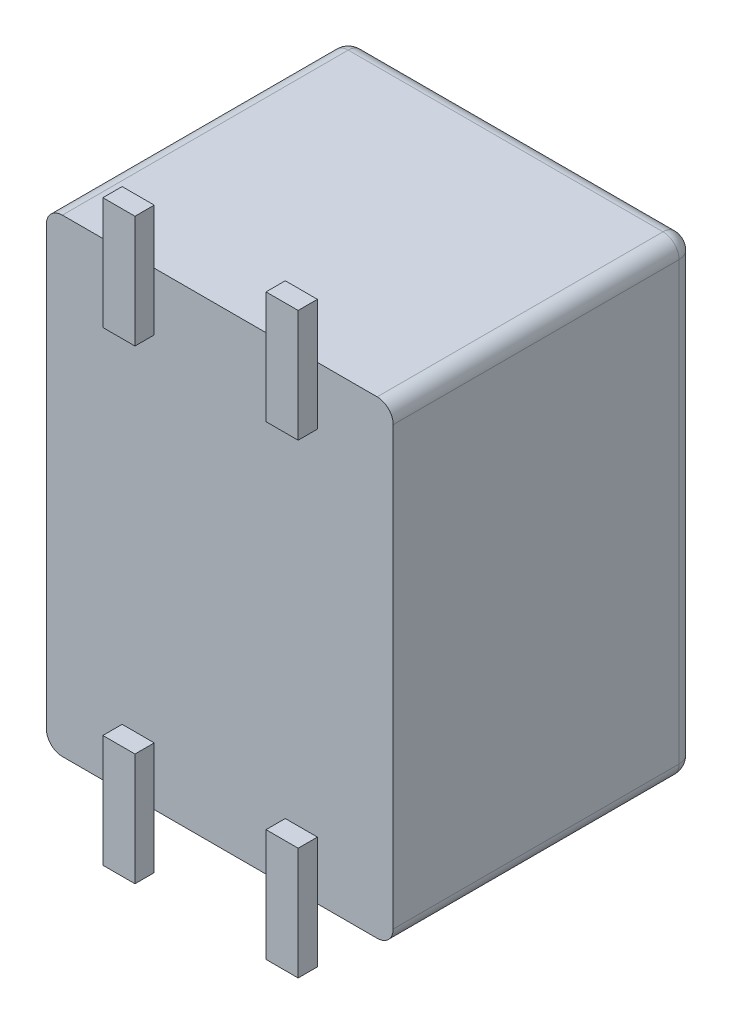
ISO-10303-21;
HEADER;
FILE_DESCRIPTION(('STEP AP214'),'2;1');
FILE_NAME('part.step','',(''),(''),'','','');
FILE_SCHEMA(('AUTOMOTIVE_DESIGN { 1 0 10303 214 1 1 1 1 }'));
ENDSEC;
DATA;
#1=APPLICATION_CONTEXT('core data for automotive mechanical design processes');
#2=APPLICATION_PROTOCOL_DEFINITION('international standard','automotive_design',2000,#1);
#3=PRODUCT_CONTEXT('',#1,'mechanical');
#4=PRODUCT('Part','Part','',(#3));
#5=PRODUCT_RELATED_PRODUCT_CATEGORY('part','',(#4));
#6=PRODUCT_DEFINITION_FORMATION('','',#4);
#7=PRODUCT_DEFINITION_CONTEXT('part definition',#1,'design');
#8=PRODUCT_DEFINITION('design','',#6,#7);
#9=PRODUCT_DEFINITION_SHAPE('','',#8);
#10=(LENGTH_UNIT() NAMED_UNIT(*) SI_UNIT(.MILLI.,.METRE.));
#11=(NAMED_UNIT(*) PLANE_ANGLE_UNIT() SI_UNIT($,.RADIAN.));
#12=(NAMED_UNIT(*) SI_UNIT($,.STERADIAN.) SOLID_ANGLE_UNIT());
#13=UNCERTAINTY_MEASURE_WITH_UNIT(LENGTH_MEASURE(1.E-05),#10,'distance_accuracy_value','');
#14=(GEOMETRIC_REPRESENTATION_CONTEXT(3) GLOBAL_UNCERTAINTY_ASSIGNED_CONTEXT((#13)) GLOBAL_UNIT_ASSIGNED_CONTEXT((#10,
#11,#12)) REPRESENTATION_CONTEXT('',''));
#15=CARTESIAN_POINT('',(0.,0.,0.));
#16=DIRECTION('',(0.,0.,1.));
#17=DIRECTION('',(1.,0.,0.));
#18=AXIS2_PLACEMENT_3D('',#15,#16,#17);
#19=CARTESIAN_POINT('',(-2.45,-3.4,-2.1));
#20=DIRECTION('',(0.,0.707106781186548,-0.707106781186548));
#21=DIRECTION('',(0.,-0.707106781186548,-0.707106781186548));
#22=AXIS2_PLACEMENT_3D('',#19,#20,#21);
#23=SPHERICAL_SURFACE('',#22,0.25);
#24=CARTESIAN_POINT('',(-2.45,-3.4,-2.1));
#25=DIRECTION('',(0.,0.,-1.));
#26=DIRECTION('',(0.,-1.,0.));
#27=AXIS2_PLACEMENT_3D('',#24,#25,#26);
#28=CIRCLE('',#27,0.25);
#29=CARTESIAN_POINT('',(-2.45,-3.65,-2.1));
#30=VERTEX_POINT('',#29);
#31=CARTESIAN_POINT('',(-2.7,-3.4,-2.1));
#32=VERTEX_POINT('',#31);
#33=EDGE_CURVE('E1019',#30,#32,#28,.T.);
#34=ORIENTED_EDGE('',*,*,#33,.T.);
#35=CARTESIAN_POINT('',(-2.45,-3.4,-2.1));
#36=DIRECTION('',(0.,-1.,0.));
#37=DIRECTION('',(-1.,0.,0.));
#38=AXIS2_PLACEMENT_3D('',#35,#36,#37);
#39=CIRCLE('',#38,0.25);
#40=CARTESIAN_POINT('',(-2.45,-3.4,-2.35));
#41=VERTEX_POINT('',#40);
#42=EDGE_CURVE('E318',#32,#41,#39,.T.);
#43=ORIENTED_EDGE('',*,*,#42,.T.);
#44=CARTESIAN_POINT('',(-2.45,-3.4,-2.1));
#45=DIRECTION('',(-1.,0.,0.));
#46=DIRECTION('',(0.,0.,-1.));
#47=AXIS2_PLACEMENT_3D('',#44,#45,#46);
#48=CIRCLE('',#47,0.25);
#49=EDGE_CURVE('E11',#41,#30,#48,.T.);
#50=ORIENTED_EDGE('',*,*,#49,.T.);
#51=EDGE_LOOP('',(#34,#43,#50));
#52=FACE_BOUND('',#51,.T.);
#53=ADVANCED_FACE('F17',(#52),#23,.T.);
#54=CARTESIAN_POINT('',(9.73944,-3.4,-2.1));
#55=DIRECTION('',(1.,0.,0.));
#56=DIRECTION('',(0.,0.,-1.));
#57=AXIS2_PLACEMENT_3D('',#54,#55,#56);
#58=CYLINDRICAL_SURFACE('',#57,0.25);
#59=CARTESIAN_POINT('',(2.45,-3.4,-2.1));
#60=DIRECTION('',(1.,0.,0.));
#61=DIRECTION('',(0.,-1.,0.));
#62=AXIS2_PLACEMENT_3D('',#59,#60,#61);
#63=CIRCLE('',#62,0.25);
#64=CARTESIAN_POINT('',(2.45,-3.65,-2.1));
#65=VERTEX_POINT('',#64);
#66=CARTESIAN_POINT('',(2.45,-3.4,-2.35));
#67=VERTEX_POINT('',#66);
#68=EDGE_CURVE('E20',#65,#67,#63,.T.);
#69=ORIENTED_EDGE('',*,*,#68,.F.);
#70=DIRECTION('',(-1.,0.,0.));
#71=VECTOR('',#70,1.);
#72=CARTESIAN_POINT('',(2.45,-3.65,-2.1));
#73=LINE('',#72,#71);
#74=EDGE_CURVE('E444',#65,#30,#73,.T.);
#75=ORIENTED_EDGE('',*,*,#74,.T.);
#76=ORIENTED_EDGE('',*,*,#49,.F.);
#77=DIRECTION('',(-1.,0.,0.));
#78=VECTOR('',#77,1.);
#79=CARTESIAN_POINT('',(2.45,-3.4,-2.35));
#80=LINE('',#79,#78);
#81=EDGE_CURVE('E303',#67,#41,#80,.T.);
#82=ORIENTED_EDGE('',*,*,#81,.F.);
#83=EDGE_LOOP('',(#69,#75,#76,#82));
#84=FACE_BOUND('',#83,.T.);
#85=ADVANCED_FACE('F308',(#84),#58,.T.);
#86=CARTESIAN_POINT('',(2.45,-3.4,-2.1));
#87=DIRECTION('',(-0.707106781186548,0.,-0.707106781186548));
#88=DIRECTION('',(0.707106781186548,0.,-0.707106781186548));
#89=AXIS2_PLACEMENT_3D('',#86,#87,#88);
#90=SPHERICAL_SURFACE('',#89,0.25);
#91=ORIENTED_EDGE('',*,*,#68,.T.);
#92=CARTESIAN_POINT('',(2.45,-3.4,-2.1));
#93=DIRECTION('',(0.,-1.,0.));
#94=DIRECTION('',(0.,0.,-1.));
#95=AXIS2_PLACEMENT_3D('',#92,#93,#94);
#96=CIRCLE('',#95,0.25);
#97=CARTESIAN_POINT('',(2.7,-3.4,-2.1));
#98=VERTEX_POINT('',#97);
#99=EDGE_CURVE('E282',#67,#98,#96,.T.);
#100=ORIENTED_EDGE('',*,*,#99,.T.);
#101=CARTESIAN_POINT('',(2.45,-3.4,-2.1));
#102=DIRECTION('',(0.,0.,-1.));
#103=DIRECTION('',(1.,0.,0.));
#104=AXIS2_PLACEMENT_3D('',#101,#102,#103);
#105=CIRCLE('',#104,0.25);
#106=EDGE_CURVE('E283',#98,#65,#105,.T.);
#107=ORIENTED_EDGE('',*,*,#106,.T.);
#108=EDGE_LOOP('',(#91,#100,#107));
#109=FACE_BOUND('',#108,.T.);
#110=ADVANCED_FACE('F281',(#109),#90,.T.);
#111=CARTESIAN_POINT('',(2.45,-3.4,9.168));
#112=DIRECTION('',(0.,0.,1.));
#113=DIRECTION('',(1.,0.,0.));
#114=AXIS2_PLACEMENT_3D('',#111,#112,#113);
#115=CYLINDRICAL_SURFACE('',#114,0.25);
#116=DIRECTION('',(0.,0.,-1.));
#117=VECTOR('',#116,1.);
#118=CARTESIAN_POINT('',(2.45,-3.65,2.35));
#119=LINE('',#118,#117);
#120=CARTESIAN_POINT('',(2.45,-3.65,2.35));
#121=VERTEX_POINT('',#120);
#122=EDGE_CURVE('E441',#121,#65,#119,.T.);
#123=ORIENTED_EDGE('',*,*,#122,.T.);
#124=ORIENTED_EDGE('',*,*,#106,.F.);
#125=DIRECTION('',(0.,0.,-1.));
#126=VECTOR('',#125,1.);
#127=CARTESIAN_POINT('',(2.7,-3.4,2.35));
#128=LINE('',#127,#126);
#129=CARTESIAN_POINT('',(2.7,-3.4,2.35));
#130=VERTEX_POINT('',#129);
#131=EDGE_CURVE('E404',#130,#98,#128,.T.);
#132=ORIENTED_EDGE('',*,*,#131,.F.);
#133=CARTESIAN_POINT('',(2.45,-3.4,2.35));
#134=DIRECTION('',(0.,0.,1.));
#135=DIRECTION('',(0.,-1.,0.));
#136=AXIS2_PLACEMENT_3D('',#133,#134,#135);
#137=CIRCLE('',#136,0.25);
#138=EDGE_CURVE('E1097',#121,#130,#137,.T.);
#139=ORIENTED_EDGE('',*,*,#138,.F.);
#140=EDGE_LOOP('',(#123,#124,#132,#139));
#141=FACE_BOUND('',#140,.T.);
#142=ADVANCED_FACE('F900',(#141),#115,.T.);
#143=CARTESIAN_POINT('',(-2.7,-3.65,2.35));
#144=DIRECTION('',(0.,-1.,0.));
#145=DIRECTION('',(0.,0.,-1.));
#146=AXIS2_PLACEMENT_3D('',#143,#144,#145);
#147=PLANE('',#146);
#148=ORIENTED_EDGE('',*,*,#74,.F.);
#149=ORIENTED_EDGE('',*,*,#122,.F.);
#150=DIRECTION('',(1.,0.,0.));
#151=VECTOR('',#150,1.);
#152=CARTESIAN_POINT('',(1.52,-3.65,2.35));
#153=LINE('',#152,#151);
#154=CARTESIAN_POINT('',(1.52,-3.65,2.35));
#155=VERTEX_POINT('',#154);
#156=EDGE_CURVE('E1093',#155,#121,#153,.T.);
#157=ORIENTED_EDGE('',*,*,#156,.F.);
#158=DIRECTION('',(1.,0.,0.));
#159=VECTOR('',#158,1.);
#160=CARTESIAN_POINT('',(1.02,-3.65,2.35));
#161=LINE('',#160,#159);
#162=CARTESIAN_POINT('',(1.02,-3.65,2.35));
#163=VERTEX_POINT('',#162);
#164=EDGE_CURVE('E462',#163,#155,#161,.T.);
#165=ORIENTED_EDGE('',*,*,#164,.F.);
#166=DIRECTION('',(1.,0.,0.));
#167=VECTOR('',#166,1.);
#168=CARTESIAN_POINT('',(-1.02,-3.65,2.35));
#169=LINE('',#168,#167);
#170=CARTESIAN_POINT('',(-1.02,-3.65,2.35));
#171=VERTEX_POINT('',#170);
#172=EDGE_CURVE('E1075',#171,#163,#169,.T.);
#173=ORIENTED_EDGE('',*,*,#172,.F.);
#174=DIRECTION('',(1.,0.,0.));
#175=VECTOR('',#174,1.);
#176=CARTESIAN_POINT('',(-1.52,-3.65,2.35));
#177=LINE('',#176,#175);
#178=CARTESIAN_POINT('',(-1.52,-3.65,2.35));
#179=VERTEX_POINT('',#178);
#180=EDGE_CURVE('E440',#179,#171,#177,.T.);
#181=ORIENTED_EDGE('',*,*,#180,.F.);
#182=DIRECTION('',(1.,0.,0.));
#183=VECTOR('',#182,1.);
#184=CARTESIAN_POINT('',(-2.45,-3.65,2.35));
#185=LINE('',#184,#183);
#186=CARTESIAN_POINT('',(-2.45,-3.65,2.35));
#187=VERTEX_POINT('',#186);
#188=EDGE_CURVE('E1085',#187,#179,#185,.T.);
#189=ORIENTED_EDGE('',*,*,#188,.F.);
#190=DIRECTION('',(0.,0.,1.));
#191=VECTOR('',#190,1.);
#192=CARTESIAN_POINT('',(-2.45,-3.65,-2.1));
#193=LINE('',#192,#191);
#194=EDGE_CURVE('E1023',#30,#187,#193,.T.);
#195=ORIENTED_EDGE('',*,*,#194,.F.);
#196=EDGE_LOOP('',(#148,#149,#157,#165,#173,#181,#189,#195));
#197=FACE_BOUND('',#196,.T.);
#198=ADVANCED_FACE('F826',(#197),#147,.T.);
#199=CARTESIAN_POINT('',(-1.52,-4.5,2.35));
#200=DIRECTION('',(0.,-1.,0.));
#201=DIRECTION('',(0.,0.,-1.));
#202=AXIS2_PLACEMENT_3D('',#199,#200,#201);
#203=PLANE('',#202);
#204=DIRECTION('',(0.,0.,1.));
#205=VECTOR('',#204,1.);
#206=CARTESIAN_POINT('',(-1.02,-4.5,2.35));
#207=LINE('',#206,#205);
#208=CARTESIAN_POINT('',(-1.02,-4.5,2.35));
#209=VERTEX_POINT('',#208);
#210=CARTESIAN_POINT('',(-1.02,-4.5,2.65));
#211=VERTEX_POINT('',#210);
#212=EDGE_CURVE('E476',#209,#211,#207,.T.);
#213=ORIENTED_EDGE('',*,*,#212,.T.);
#214=DIRECTION('',(1.,0.,0.));
#215=VECTOR('',#214,1.);
#216=CARTESIAN_POINT('',(-1.52,-4.5,2.65));
#217=LINE('',#216,#215);
#218=CARTESIAN_POINT('',(-1.52,-4.5,2.65));
#219=VERTEX_POINT('',#218);
#220=EDGE_CURVE('E360',#219,#211,#217,.T.);
#221=ORIENTED_EDGE('',*,*,#220,.F.);
#222=DIRECTION('',(0.,0.,1.));
#223=VECTOR('',#222,1.);
#224=CARTESIAN_POINT('',(-1.52,-4.5,2.35));
#225=LINE('',#224,#223);
#226=CARTESIAN_POINT('',(-1.52,-4.5,2.35));
#227=VERTEX_POINT('',#226);
#228=EDGE_CURVE('E341',#227,#219,#225,.T.);
#229=ORIENTED_EDGE('',*,*,#228,.F.);
#230=DIRECTION('',(1.,0.,0.));
#231=VECTOR('',#230,1.);
#232=CARTESIAN_POINT('',(-1.52,-4.5,2.35));
#233=LINE('',#232,#231);
#234=EDGE_CURVE('E376',#227,#209,#233,.T.);
#235=ORIENTED_EDGE('',*,*,#234,.T.);
#236=EDGE_LOOP('',(#213,#221,#229,#235));
#237=FACE_BOUND('',#236,.T.);
#238=ADVANCED_FACE('F821',(#237),#203,.T.);
#239=CARTESIAN_POINT('',(-1.02,-4.5,2.35));
#240=DIRECTION('',(1.,0.,0.));
#241=DIRECTION('',(0.,1.,0.));
#242=AXIS2_PLACEMENT_3D('',#239,#240,#241);
#243=PLANE('',#242);
#244=DIRECTION('',(0.,0.,1.));
#245=VECTOR('',#244,1.);
#246=CARTESIAN_POINT('',(-1.02,-2.75,2.35));
#247=LINE('',#246,#245);
#248=CARTESIAN_POINT('',(-1.02,-2.75,2.35));
#249=VERTEX_POINT('',#248);
#250=CARTESIAN_POINT('',(-1.02,-2.75,2.65));
#251=VERTEX_POINT('',#250);
#252=EDGE_CURVE('E479',#249,#251,#247,.T.);
#253=ORIENTED_EDGE('',*,*,#252,.T.);
#254=DIRECTION('',(0.,1.,0.));
#255=VECTOR('',#254,1.);
#256=CARTESIAN_POINT('',(-1.02,-4.5,2.65));
#257=LINE('',#256,#255);
#258=EDGE_CURVE('E455',#211,#251,#257,.T.);
#259=ORIENTED_EDGE('',*,*,#258,.F.);
#260=ORIENTED_EDGE('',*,*,#212,.F.);
#261=DIRECTION('',(0.,1.,0.));
#262=VECTOR('',#261,1.);
#263=CARTESIAN_POINT('',(-1.02,-4.5,2.35));
#264=LINE('',#263,#262);
#265=EDGE_CURVE('E372',#209,#171,#264,.T.);
#266=ORIENTED_EDGE('',*,*,#265,.T.);
#267=DIRECTION('',(0.,1.,0.));
#268=VECTOR('',#267,1.);
#269=CARTESIAN_POINT('',(-1.02,-3.65,2.35));
#270=LINE('',#269,#268);
#271=EDGE_CURVE('E1110',#171,#249,#270,.T.);
#272=ORIENTED_EDGE('',*,*,#271,.T.);
#273=EDGE_LOOP('',(#253,#259,#260,#266,#272));
#274=FACE_BOUND('',#273,.T.);
#275=ADVANCED_FACE('F644',(#274),#243,.T.);
#276=CARTESIAN_POINT('',(-1.02,-2.75,2.35));
#277=DIRECTION('',(0.,1.,0.));
#278=DIRECTION('',(1.,0.,0.));
#279=AXIS2_PLACEMENT_3D('',#276,#277,#278);
#280=PLANE('',#279);
#281=DIRECTION('',(0.,0.,1.));
#282=VECTOR('',#281,1.);
#283=CARTESIAN_POINT('',(-1.52,-2.75,2.35));
#284=LINE('',#283,#282);
#285=CARTESIAN_POINT('',(-1.52,-2.75,2.35));
#286=VERTEX_POINT('',#285);
#287=CARTESIAN_POINT('',(-1.52,-2.75,2.65));
#288=VERTEX_POINT('',#287);
#289=EDGE_CURVE('E47',#286,#288,#284,.T.);
#290=ORIENTED_EDGE('',*,*,#289,.T.);
#291=DIRECTION('',(-1.,0.,0.));
#292=VECTOR('',#291,1.);
#293=CARTESIAN_POINT('',(-1.02,-2.75,2.65));
#294=LINE('',#293,#292);
#295=EDGE_CURVE('E1053',#251,#288,#294,.T.);
#296=ORIENTED_EDGE('',*,*,#295,.F.);
#297=ORIENTED_EDGE('',*,*,#252,.F.);
#298=DIRECTION('',(-1.,0.,0.));
#299=VECTOR('',#298,1.);
#300=CARTESIAN_POINT('',(-1.02,-2.75,2.35));
#301=LINE('',#300,#299);
#302=EDGE_CURVE('E1104',#249,#286,#301,.T.);
#303=ORIENTED_EDGE('',*,*,#302,.T.);
#304=EDGE_LOOP('',(#290,#296,#297,#303));
#305=FACE_BOUND('',#304,.T.);
#306=ADVANCED_FACE('F638',(#305),#280,.T.);
#307=CARTESIAN_POINT('',(-1.52,-2.75,2.35));
#308=DIRECTION('',(-1.,0.,0.));
#309=DIRECTION('',(0.,0.,1.));
#310=AXIS2_PLACEMENT_3D('',#307,#308,#309);
#311=PLANE('',#310);
#312=DIRECTION('',(0.,-1.,0.));
#313=VECTOR('',#312,1.);
#314=CARTESIAN_POINT('',(-1.52,-3.65,2.35));
#315=LINE('',#314,#313);
#316=EDGE_CURVE('E436',#179,#227,#315,.T.);
#317=ORIENTED_EDGE('',*,*,#316,.T.);
#318=ORIENTED_EDGE('',*,*,#228,.T.);
#319=DIRECTION('',(0.,-1.,0.));
#320=VECTOR('',#319,1.);
#321=CARTESIAN_POINT('',(-1.52,-2.75,2.65));
#322=LINE('',#321,#320);
#323=EDGE_CURVE('E322',#288,#219,#322,.T.);
#324=ORIENTED_EDGE('',*,*,#323,.F.);
#325=ORIENTED_EDGE('',*,*,#289,.F.);
#326=DIRECTION('',(0.,1.,0.));
#327=VECTOR('',#326,1.);
#328=CARTESIAN_POINT('',(-1.52,-3.65,2.35));
#329=LINE('',#328,#327);
#330=EDGE_CURVE('E1089',#179,#286,#329,.T.);
#331=ORIENTED_EDGE('',*,*,#330,.F.);
#332=EDGE_LOOP('',(#317,#318,#324,#325,#331));
#333=FACE_BOUND('',#332,.T.);
#334=ADVANCED_FACE('F643',(#333),#311,.T.);
#335=CARTESIAN_POINT('',(1.52,4.5,2.35));
#336=DIRECTION('',(0.,1.,0.));
#337=DIRECTION('',(1.,0.,0.));
#338=AXIS2_PLACEMENT_3D('',#335,#336,#337);
#339=PLANE('',#338);
#340=DIRECTION('',(0.,0.,1.));
#341=VECTOR('',#340,1.);
#342=CARTESIAN_POINT('',(1.02,4.5,2.35));
#343=LINE('',#342,#341);
#344=CARTESIAN_POINT('',(1.02,4.5,2.35));
#345=VERTEX_POINT('',#344);
#346=CARTESIAN_POINT('',(1.02,4.5,2.65));
#347=VERTEX_POINT('',#346);
#348=EDGE_CURVE('E338',#345,#347,#343,.T.);
#349=ORIENTED_EDGE('',*,*,#348,.T.);
#350=DIRECTION('',(-1.,0.,0.));
#351=VECTOR('',#350,1.);
#352=CARTESIAN_POINT('',(1.52,4.5,2.65));
#353=LINE('',#352,#351);
#354=CARTESIAN_POINT('',(1.52,4.5,2.65));
#355=VERTEX_POINT('',#354);
#356=EDGE_CURVE('E484',#355,#347,#353,.T.);
#357=ORIENTED_EDGE('',*,*,#356,.F.);
#358=DIRECTION('',(0.,0.,1.));
#359=VECTOR('',#358,1.);
#360=CARTESIAN_POINT('',(1.52,4.5,2.35));
#361=LINE('',#360,#359);
#362=CARTESIAN_POINT('',(1.52,4.5,2.35));
#363=VERTEX_POINT('',#362);
#364=EDGE_CURVE('E392',#363,#355,#361,.T.);
#365=ORIENTED_EDGE('',*,*,#364,.F.);
#366=DIRECTION('',(-1.,0.,0.));
#367=VECTOR('',#366,1.);
#368=CARTESIAN_POINT('',(1.52,4.5,2.35));
#369=LINE('',#368,#367);
#370=EDGE_CURVE('E430',#363,#345,#369,.T.);
#371=ORIENTED_EDGE('',*,*,#370,.T.);
#372=EDGE_LOOP('',(#349,#357,#365,#371));
#373=FACE_BOUND('',#372,.T.);
#374=ADVANCED_FACE('F856',(#373),#339,.T.);
#375=CARTESIAN_POINT('',(1.02,4.5,2.35));
#376=DIRECTION('',(-1.,0.,0.));
#377=DIRECTION('',(0.,0.,1.));
#378=AXIS2_PLACEMENT_3D('',#375,#376,#377);
#379=PLANE('',#378);
#380=DIRECTION('',(0.,0.,1.));
#381=VECTOR('',#380,1.);
#382=CARTESIAN_POINT('',(1.02,2.75,2.35));
#383=LINE('',#382,#381);
#384=CARTESIAN_POINT('',(1.02,2.75,2.35));
#385=VERTEX_POINT('',#384);
#386=CARTESIAN_POINT('',(1.02,2.75,2.65));
#387=VERTEX_POINT('',#386);
#388=EDGE_CURVE('E342',#385,#387,#383,.T.);
#389=ORIENTED_EDGE('',*,*,#388,.T.);
#390=DIRECTION('',(0.,-1.,0.));
#391=VECTOR('',#390,1.);
#392=CARTESIAN_POINT('',(1.02,4.5,2.65));
#393=LINE('',#392,#391);
#394=EDGE_CURVE('E488',#347,#387,#393,.T.);
#395=ORIENTED_EDGE('',*,*,#394,.F.);
#396=ORIENTED_EDGE('',*,*,#348,.F.);
#397=DIRECTION('',(0.,-1.,0.));
#398=VECTOR('',#397,1.);
#399=CARTESIAN_POINT('',(1.02,4.5,2.35));
#400=LINE('',#399,#398);
#401=CARTESIAN_POINT('',(1.02,3.65,2.35));
#402=VERTEX_POINT('',#401);
#403=EDGE_CURVE('E1060',#345,#402,#400,.T.);
#404=ORIENTED_EDGE('',*,*,#403,.T.);
#405=DIRECTION('',(0.,-1.,0.));
#406=VECTOR('',#405,1.);
#407=CARTESIAN_POINT('',(1.02,3.65,2.35));
#408=LINE('',#407,#406);
#409=EDGE_CURVE('E333',#402,#385,#408,.T.);
#410=ORIENTED_EDGE('',*,*,#409,.T.);
#411=EDGE_LOOP('',(#389,#395,#396,#404,#410));
#412=FACE_BOUND('',#411,.T.);
#413=ADVANCED_FACE('F846',(#412),#379,.T.);
#414=CARTESIAN_POINT('',(1.02,2.75,2.35));
#415=DIRECTION('',(0.,-1.,0.));
#416=DIRECTION('',(0.,0.,-1.));
#417=AXIS2_PLACEMENT_3D('',#414,#415,#416);
#418=PLANE('',#417);
#419=DIRECTION('',(0.,0.,1.));
#420=VECTOR('',#419,1.);
#421=CARTESIAN_POINT('',(1.52,2.75,2.35));
#422=LINE('',#421,#420);
#423=CARTESIAN_POINT('',(1.52,2.75,2.35));
#424=VERTEX_POINT('',#423);
#425=CARTESIAN_POINT('',(1.52,2.75,2.65));
#426=VERTEX_POINT('',#425);
#427=EDGE_CURVE('E389',#424,#426,#422,.T.);
#428=ORIENTED_EDGE('',*,*,#427,.T.);
#429=DIRECTION('',(1.,0.,0.));
#430=VECTOR('',#429,1.);
#431=CARTESIAN_POINT('',(1.02,2.75,2.65));
#432=LINE('',#431,#430);
#433=EDGE_CURVE('E361',#387,#426,#432,.T.);
#434=ORIENTED_EDGE('',*,*,#433,.F.);
#435=ORIENTED_EDGE('',*,*,#388,.F.);
#436=DIRECTION('',(1.,0.,0.));
#437=VECTOR('',#436,1.);
#438=CARTESIAN_POINT('',(1.02,2.75,2.35));
#439=LINE('',#438,#437);
#440=EDGE_CURVE('E329',#385,#424,#439,.T.);
#441=ORIENTED_EDGE('',*,*,#440,.T.);
#442=EDGE_LOOP('',(#428,#434,#435,#441));
#443=FACE_BOUND('',#442,.T.);
#444=ADVANCED_FACE('F836',(#443),#418,.T.);
#445=CARTESIAN_POINT('',(1.52,2.75,2.35));
#446=DIRECTION('',(1.,0.,0.));
#447=DIRECTION('',(0.,1.,0.));
#448=AXIS2_PLACEMENT_3D('',#445,#446,#447);
#449=PLANE('',#448);
#450=DIRECTION('',(0.,1.,0.));
#451=VECTOR('',#450,1.);
#452=CARTESIAN_POINT('',(1.52,3.65,2.35));
#453=LINE('',#452,#451);
#454=CARTESIAN_POINT('',(1.52,3.65,2.35));
#455=VERTEX_POINT('',#454);
#456=EDGE_CURVE('E377',#455,#363,#453,.T.);
#457=ORIENTED_EDGE('',*,*,#456,.T.);
#458=ORIENTED_EDGE('',*,*,#364,.T.);
#459=DIRECTION('',(0.,1.,0.));
#460=VECTOR('',#459,1.);
#461=CARTESIAN_POINT('',(1.52,2.75,2.65));
#462=LINE('',#461,#460);
#463=EDGE_CURVE('E356',#426,#355,#462,.T.);
#464=ORIENTED_EDGE('',*,*,#463,.F.);
#465=ORIENTED_EDGE('',*,*,#427,.F.);
#466=DIRECTION('',(0.,-1.,0.));
#467=VECTOR('',#466,1.);
#468=CARTESIAN_POINT('',(1.52,3.65,2.35));
#469=LINE('',#468,#467);
#470=EDGE_CURVE('E334',#455,#424,#469,.T.);
#471=ORIENTED_EDGE('',*,*,#470,.F.);
#472=EDGE_LOOP('',(#457,#458,#464,#465,#471));
#473=FACE_BOUND('',#472,.T.);
#474=ADVANCED_FACE('F814',(#473),#449,.T.);
#475=CARTESIAN_POINT('',(1.02,-2.75,2.35));
#476=DIRECTION('',(-1.,0.,0.));
#477=DIRECTION('',(0.,0.,1.));
#478=AXIS2_PLACEMENT_3D('',#475,#476,#477);
#479=PLANE('',#478);
#480=DIRECTION('',(0.,-1.,0.));
#481=VECTOR('',#480,1.);
#482=CARTESIAN_POINT('',(1.02,-3.65,2.35));
#483=LINE('',#482,#481);
#484=CARTESIAN_POINT('',(1.02,-4.5,2.35));
#485=VERTEX_POINT('',#484);
#486=EDGE_CURVE('E459',#163,#485,#483,.T.);
#487=ORIENTED_EDGE('',*,*,#486,.T.);
#488=DIRECTION('',(0.,0.,1.));
#489=VECTOR('',#488,1.);
#490=CARTESIAN_POINT('',(1.02,-4.5,2.35));
#491=LINE('',#490,#489);
#492=CARTESIAN_POINT('',(1.02,-4.5,2.65));
#493=VERTEX_POINT('',#492);
#494=EDGE_CURVE('E500',#485,#493,#491,.T.);
#495=ORIENTED_EDGE('',*,*,#494,.T.);
#496=DIRECTION('',(0.,-1.,0.));
#497=VECTOR('',#496,1.);
#498=CARTESIAN_POINT('',(1.02,-2.75,2.65));
#499=LINE('',#498,#497);
#500=CARTESIAN_POINT('',(1.02,-2.75,2.65));
#501=VERTEX_POINT('',#500);
#502=EDGE_CURVE('E414',#501,#493,#499,.T.);
#503=ORIENTED_EDGE('',*,*,#502,.F.);
#504=DIRECTION('',(0.,0.,1.));
#505=VECTOR('',#504,1.);
#506=CARTESIAN_POINT('',(1.02,-2.75,2.35));
#507=LINE('',#506,#505);
#508=CARTESIAN_POINT('',(1.02,-2.75,2.35));
#509=VERTEX_POINT('',#508);
#510=EDGE_CURVE('E435',#509,#501,#507,.T.);
#511=ORIENTED_EDGE('',*,*,#510,.F.);
#512=DIRECTION('',(0.,1.,0.));
#513=VECTOR('',#512,1.);
#514=CARTESIAN_POINT('',(1.02,-3.65,2.35));
#515=LINE('',#514,#513);
#516=EDGE_CURVE('E1071',#163,#509,#515,.T.);
#517=ORIENTED_EDGE('',*,*,#516,.F.);
#518=EDGE_LOOP('',(#487,#495,#503,#511,#517));
#519=FACE_BOUND('',#518,.T.);
#520=ADVANCED_FACE('F804',(#519),#479,.T.);
#521=CARTESIAN_POINT('',(1.02,-4.5,2.35));
#522=DIRECTION('',(0.,-1.,0.));
#523=DIRECTION('',(0.,0.,-1.));
#524=AXIS2_PLACEMENT_3D('',#521,#522,#523);
#525=PLANE('',#524);
#526=DIRECTION('',(0.,0.,1.));
#527=VECTOR('',#526,1.);
#528=CARTESIAN_POINT('',(1.52,-4.5,2.35));
#529=LINE('',#528,#527);
#530=CARTESIAN_POINT('',(1.52,-4.5,2.35));
#531=VERTEX_POINT('',#530);
#532=CARTESIAN_POINT('',(1.52,-4.5,2.65));
#533=VERTEX_POINT('',#532);
#534=EDGE_CURVE('E434',#531,#533,#529,.T.);
#535=ORIENTED_EDGE('',*,*,#534,.T.);
#536=DIRECTION('',(1.,0.,0.));
#537=VECTOR('',#536,1.);
#538=CARTESIAN_POINT('',(1.02,-4.5,2.65));
#539=LINE('',#538,#537);
#540=EDGE_CURVE('E409',#493,#533,#539,.T.);
#541=ORIENTED_EDGE('',*,*,#540,.F.);
#542=ORIENTED_EDGE('',*,*,#494,.F.);
#543=DIRECTION('',(1.,0.,0.));
#544=VECTOR('',#543,1.);
#545=CARTESIAN_POINT('',(1.02,-4.5,2.35));
#546=LINE('',#545,#544);
#547=EDGE_CURVE('E451',#485,#531,#546,.T.);
#548=ORIENTED_EDGE('',*,*,#547,.T.);
#549=EDGE_LOOP('',(#535,#541,#542,#548));
#550=FACE_BOUND('',#549,.T.);
#551=ADVANCED_FACE('F729',(#550),#525,.T.);
#552=CARTESIAN_POINT('',(1.52,-4.5,2.35));
#553=DIRECTION('',(1.,0.,0.));
#554=DIRECTION('',(0.,1.,0.));
#555=AXIS2_PLACEMENT_3D('',#552,#553,#554);
#556=PLANE('',#555);
#557=DIRECTION('',(0.,0.,1.));
#558=VECTOR('',#557,1.);
#559=CARTESIAN_POINT('',(1.52,-2.75,2.35));
#560=LINE('',#559,#558);
#561=CARTESIAN_POINT('',(1.52,-2.75,2.35));
#562=VERTEX_POINT('',#561);
#563=CARTESIAN_POINT('',(1.52,-2.75,2.65));
#564=VERTEX_POINT('',#563);
#565=EDGE_CURVE('E431',#562,#564,#560,.T.);
#566=ORIENTED_EDGE('',*,*,#565,.T.);
#567=DIRECTION('',(0.,1.,0.));
#568=VECTOR('',#567,1.);
#569=CARTESIAN_POINT('',(1.52,-4.5,2.65));
#570=LINE('',#569,#568);
#571=EDGE_CURVE('E413',#533,#564,#570,.T.);
#572=ORIENTED_EDGE('',*,*,#571,.F.);
#573=ORIENTED_EDGE('',*,*,#534,.F.);
#574=DIRECTION('',(0.,1.,0.));
#575=VECTOR('',#574,1.);
#576=CARTESIAN_POINT('',(1.52,-4.5,2.35));
#577=LINE('',#576,#575);
#578=EDGE_CURVE('E447',#531,#155,#577,.T.);
#579=ORIENTED_EDGE('',*,*,#578,.T.);
#580=DIRECTION('',(0.,1.,0.));
#581=VECTOR('',#580,1.);
#582=CARTESIAN_POINT('',(1.52,-3.65,2.35));
#583=LINE('',#582,#581);
#584=EDGE_CURVE('E1098',#155,#562,#583,.T.);
#585=ORIENTED_EDGE('',*,*,#584,.T.);
#586=EDGE_LOOP('',(#566,#572,#573,#579,#585));
#587=FACE_BOUND('',#586,.T.);
#588=ADVANCED_FACE('F723',(#587),#556,.T.);
#589=CARTESIAN_POINT('',(1.52,-2.75,2.35));
#590=DIRECTION('',(0.,1.,0.));
#591=DIRECTION('',(1.,0.,0.));
#592=AXIS2_PLACEMENT_3D('',#589,#590,#591);
#593=PLANE('',#592);
#594=ORIENTED_EDGE('',*,*,#510,.T.);
#595=DIRECTION('',(-1.,0.,0.));
#596=VECTOR('',#595,1.);
#597=CARTESIAN_POINT('',(1.52,-2.75,2.65));
#598=LINE('',#597,#596);
#599=EDGE_CURVE('E489',#564,#501,#598,.T.);
#600=ORIENTED_EDGE('',*,*,#599,.F.);
#601=ORIENTED_EDGE('',*,*,#565,.F.);
#602=DIRECTION('',(-1.,0.,0.));
#603=VECTOR('',#602,1.);
#604=CARTESIAN_POINT('',(1.52,-2.75,2.35));
#605=LINE('',#604,#603);
#606=EDGE_CURVE('E1074',#562,#509,#605,.T.);
#607=ORIENTED_EDGE('',*,*,#606,.T.);
#608=EDGE_LOOP('',(#594,#600,#601,#607));
#609=FACE_BOUND('',#608,.T.);
#610=ADVANCED_FACE('F728',(#609),#593,.T.);
#611=CARTESIAN_POINT('',(-2.7,0.,2.65));
#612=DIRECTION('',(0.,0.,1.));
#613=DIRECTION('',(1.,0.,0.));
#614=AXIS2_PLACEMENT_3D('',#611,#612,#613);
#615=PLANE('',#614);
#616=DIRECTION('',(0.,1.,0.));
#617=VECTOR('',#616,1.);
#618=CARTESIAN_POINT('',(-1.02,2.75,2.65));
#619=LINE('',#618,#617);
#620=CARTESIAN_POINT('',(-1.02,2.75,2.65));
#621=VERTEX_POINT('',#620);
#622=CARTESIAN_POINT('',(-1.02,4.5,2.65));
#623=VERTEX_POINT('',#622);
#624=EDGE_CURVE('E467',#621,#623,#619,.T.);
#625=ORIENTED_EDGE('',*,*,#624,.T.);
#626=DIRECTION('',(-1.,0.,0.));
#627=VECTOR('',#626,1.);
#628=CARTESIAN_POINT('',(-1.02,4.5,2.65));
#629=LINE('',#628,#627);
#630=CARTESIAN_POINT('',(-1.52,4.5,2.65));
#631=VERTEX_POINT('',#630);
#632=EDGE_CURVE('E366',#623,#631,#629,.T.);
#633=ORIENTED_EDGE('',*,*,#632,.T.);
#634=DIRECTION('',(0.,-1.,0.));
#635=VECTOR('',#634,1.);
#636=CARTESIAN_POINT('',(-1.52,4.5,2.65));
#637=LINE('',#636,#635);
#638=CARTESIAN_POINT('',(-1.52,2.75,2.65));
#639=VERTEX_POINT('',#638);
#640=EDGE_CURVE('E367',#631,#639,#637,.T.);
#641=ORIENTED_EDGE('',*,*,#640,.T.);
#642=DIRECTION('',(1.,0.,0.));
#643=VECTOR('',#642,1.);
#644=CARTESIAN_POINT('',(-1.52,2.75,2.65));
#645=LINE('',#644,#643);
#646=EDGE_CURVE('E475',#639,#621,#645,.T.);
#647=ORIENTED_EDGE('',*,*,#646,.T.);
#648=EDGE_LOOP('',(#625,#633,#641,#647));
#649=FACE_BOUND('',#648,.T.);
#650=ADVANCED_FACE('F778',(#649),#615,.T.);
#651=CARTESIAN_POINT('',(-2.7,0.,2.65));
#652=DIRECTION('',(0.,0.,1.));
#653=DIRECTION('',(1.,0.,0.));
#654=AXIS2_PLACEMENT_3D('',#651,#652,#653);
#655=PLANE('',#654);
#656=ORIENTED_EDGE('',*,*,#220,.T.);
#657=ORIENTED_EDGE('',*,*,#258,.T.);
#658=ORIENTED_EDGE('',*,*,#295,.T.);
#659=ORIENTED_EDGE('',*,*,#323,.T.);
#660=EDGE_LOOP('',(#656,#657,#658,#659));
#661=FACE_BOUND('',#660,.T.);
#662=ADVANCED_FACE('F768',(#661),#655,.T.);
#663=CARTESIAN_POINT('',(-2.7,0.,2.65));
#664=DIRECTION('',(0.,0.,1.));
#665=DIRECTION('',(1.,0.,0.));
#666=AXIS2_PLACEMENT_3D('',#663,#664,#665);
#667=PLANE('',#666);
#668=ORIENTED_EDGE('',*,*,#356,.T.);
#669=ORIENTED_EDGE('',*,*,#394,.T.);
#670=ORIENTED_EDGE('',*,*,#433,.T.);
#671=ORIENTED_EDGE('',*,*,#463,.T.);
#672=EDGE_LOOP('',(#668,#669,#670,#671));
#673=FACE_BOUND('',#672,.T.);
#674=ADVANCED_FACE('F758',(#673),#667,.T.);
#675=CARTESIAN_POINT('',(-2.7,0.,2.65));
#676=DIRECTION('',(0.,0.,1.));
#677=DIRECTION('',(1.,0.,0.));
#678=AXIS2_PLACEMENT_3D('',#675,#676,#677);
#679=PLANE('',#678);
#680=ORIENTED_EDGE('',*,*,#502,.T.);
#681=ORIENTED_EDGE('',*,*,#540,.T.);
#682=ORIENTED_EDGE('',*,*,#571,.T.);
#683=ORIENTED_EDGE('',*,*,#599,.T.);
#684=EDGE_LOOP('',(#680,#681,#682,#683));
#685=FACE_BOUND('',#684,.T.);
#686=ADVANCED_FACE('F748',(#685),#679,.T.);
#687=CARTESIAN_POINT('',(-1.02,4.5,2.35));
#688=DIRECTION('',(0.,1.,0.));
#689=DIRECTION('',(1.,0.,0.));
#690=AXIS2_PLACEMENT_3D('',#687,#688,#689);
#691=PLANE('',#690);
#692=DIRECTION('',(0.,0.,1.));
#693=VECTOR('',#692,1.);
#694=CARTESIAN_POINT('',(-1.52,4.5,2.35));
#695=LINE('',#694,#693);
#696=CARTESIAN_POINT('',(-1.52,4.5,2.35));
#697=VERTEX_POINT('',#696);
#698=EDGE_CURVE('E362',#697,#631,#695,.T.);
#699=ORIENTED_EDGE('',*,*,#698,.T.);
#700=ORIENTED_EDGE('',*,*,#632,.F.);
#701=DIRECTION('',(0.,0.,1.));
#702=VECTOR('',#701,1.);
#703=CARTESIAN_POINT('',(-1.02,4.5,2.35));
#704=LINE('',#703,#702);
#705=CARTESIAN_POINT('',(-1.02,4.5,2.35));
#706=VERTEX_POINT('',#705);
#707=EDGE_CURVE('E466',#706,#623,#704,.T.);
#708=ORIENTED_EDGE('',*,*,#707,.F.);
#709=DIRECTION('',(-1.,0.,0.));
#710=VECTOR('',#709,1.);
#711=CARTESIAN_POINT('',(-1.02,4.5,2.35));
#712=LINE('',#711,#710);
#713=EDGE_CURVE('E1061',#706,#697,#712,.T.);
#714=ORIENTED_EDGE('',*,*,#713,.T.);
#715=EDGE_LOOP('',(#699,#700,#708,#714));
#716=FACE_BOUND('',#715,.T.);
#717=ADVANCED_FACE('F687',(#716),#691,.T.);
#718=CARTESIAN_POINT('',(-1.52,4.5,2.35));
#719=DIRECTION('',(-1.,0.,0.));
#720=DIRECTION('',(0.,0.,1.));
#721=AXIS2_PLACEMENT_3D('',#718,#719,#720);
#722=PLANE('',#721);
#723=DIRECTION('',(0.,0.,1.));
#724=VECTOR('',#723,1.);
#725=CARTESIAN_POINT('',(-1.52,2.75,2.35));
#726=LINE('',#725,#724);
#727=CARTESIAN_POINT('',(-1.52,2.75,2.35));
#728=VERTEX_POINT('',#727);
#729=EDGE_CURVE('E397',#728,#639,#726,.T.);
#730=ORIENTED_EDGE('',*,*,#729,.T.);
#731=ORIENTED_EDGE('',*,*,#640,.F.);
#732=ORIENTED_EDGE('',*,*,#698,.F.);
#733=DIRECTION('',(0.,-1.,0.));
#734=VECTOR('',#733,1.);
#735=CARTESIAN_POINT('',(-1.52,4.5,2.35));
#736=LINE('',#735,#734);
#737=CARTESIAN_POINT('',(-1.52,3.65,2.35));
#738=VERTEX_POINT('',#737);
#739=EDGE_CURVE('E426',#697,#738,#736,.T.);
#740=ORIENTED_EDGE('',*,*,#739,.T.);
#741=DIRECTION('',(0.,-1.,0.));
#742=VECTOR('',#741,1.);
#743=CARTESIAN_POINT('',(-1.52,3.65,2.35));
#744=LINE('',#743,#742);
#745=EDGE_CURVE('E348',#738,#728,#744,.T.);
#746=ORIENTED_EDGE('',*,*,#745,.T.);
#747=EDGE_LOOP('',(#730,#731,#732,#740,#746));
#748=FACE_BOUND('',#747,.T.);
#749=ADVANCED_FACE('F681',(#748),#722,.T.);
#750=CARTESIAN_POINT('',(-1.52,2.75,2.35));
#751=DIRECTION('',(0.,-1.,0.));
#752=DIRECTION('',(0.,0.,-1.));
#753=AXIS2_PLACEMENT_3D('',#750,#751,#752);
#754=PLANE('',#753);
#755=DIRECTION('',(0.,0.,1.));
#756=VECTOR('',#755,1.);
#757=CARTESIAN_POINT('',(-1.02,2.75,2.35));
#758=LINE('',#757,#756);
#759=CARTESIAN_POINT('',(-1.02,2.75,2.35));
#760=VERTEX_POINT('',#759);
#761=EDGE_CURVE('E471',#760,#621,#758,.T.);
#762=ORIENTED_EDGE('',*,*,#761,.T.);
#763=ORIENTED_EDGE('',*,*,#646,.F.);
#764=ORIENTED_EDGE('',*,*,#729,.F.);
#765=DIRECTION('',(1.,0.,0.));
#766=VECTOR('',#765,1.);
#767=CARTESIAN_POINT('',(-1.52,2.75,2.35));
#768=LINE('',#767,#766);
#769=EDGE_CURVE('E327',#728,#760,#768,.T.);
#770=ORIENTED_EDGE('',*,*,#769,.T.);
#771=EDGE_LOOP('',(#762,#763,#764,#770));
#772=FACE_BOUND('',#771,.T.);
#773=ADVANCED_FACE('F686',(#772),#754,.T.);
#774=CARTESIAN_POINT('',(-1.02,2.75,2.35));
#775=DIRECTION('',(1.,0.,0.));
#776=DIRECTION('',(0.,1.,0.));
#777=AXIS2_PLACEMENT_3D('',#774,#775,#776);
#778=PLANE('',#777);
#779=DIRECTION('',(0.,1.,0.));
#780=VECTOR('',#779,1.);
#781=CARTESIAN_POINT('',(-1.02,3.65,2.35));
#782=LINE('',#781,#780);
#783=CARTESIAN_POINT('',(-1.02,3.65,2.35));
#784=VERTEX_POINT('',#783);
#785=EDGE_CURVE('E1056',#784,#706,#782,.T.);
#786=ORIENTED_EDGE('',*,*,#785,.T.);
#787=ORIENTED_EDGE('',*,*,#707,.T.);
#788=ORIENTED_EDGE('',*,*,#624,.F.);
#789=ORIENTED_EDGE('',*,*,#761,.F.);
#790=DIRECTION('',(0.,-1.,0.));
#791=VECTOR('',#790,1.);
#792=CARTESIAN_POINT('',(-1.02,3.65,2.35));
#793=LINE('',#792,#791);
#794=EDGE_CURVE('E324',#784,#760,#793,.T.);
#795=ORIENTED_EDGE('',*,*,#794,.F.);
#796=EDGE_LOOP('',(#786,#787,#788,#789,#795));
#797=FACE_BOUND('',#796,.T.);
#798=ADVANCED_FACE('F708',(#797),#778,.T.);
#799=CARTESIAN_POINT('',(-2.7,0.,2.35));
#800=DIRECTION('',(0.,0.,1.));
#801=DIRECTION('',(1.,0.,0.));
#802=AXIS2_PLACEMENT_3D('',#799,#800,#801);
#803=PLANE('',#802);
#804=ORIENTED_EDGE('',*,*,#578,.F.);
#805=ORIENTED_EDGE('',*,*,#547,.F.);
#806=ORIENTED_EDGE('',*,*,#486,.F.);
#807=ORIENTED_EDGE('',*,*,#164,.T.);
#808=EDGE_LOOP('',(#804,#805,#806,#807));
#809=FACE_BOUND('',#808,.T.);
#810=ADVANCED_FACE('F698',(#809),#803,.F.);
#811=CARTESIAN_POINT('',(-2.7,0.,2.35));
#812=DIRECTION('',(0.,0.,1.));
#813=DIRECTION('',(1.,0.,0.));
#814=AXIS2_PLACEMENT_3D('',#811,#812,#813);
#815=PLANE('',#814);
#816=ORIENTED_EDGE('',*,*,#265,.F.);
#817=ORIENTED_EDGE('',*,*,#234,.F.);
#818=ORIENTED_EDGE('',*,*,#316,.F.);
#819=ORIENTED_EDGE('',*,*,#180,.T.);
#820=EDGE_LOOP('',(#816,#817,#818,#819));
#821=FACE_BOUND('',#820,.T.);
#822=ADVANCED_FACE('F674',(#821),#815,.F.);
#823=CARTESIAN_POINT('',(-2.7,0.,2.35));
#824=DIRECTION('',(0.,0.,1.));
#825=DIRECTION('',(1.,0.,0.));
#826=AXIS2_PLACEMENT_3D('',#823,#824,#825);
#827=PLANE('',#826);
#828=ORIENTED_EDGE('',*,*,#403,.F.);
#829=ORIENTED_EDGE('',*,*,#370,.F.);
#830=ORIENTED_EDGE('',*,*,#456,.F.);
#831=DIRECTION('',(1.,0.,0.));
#832=VECTOR('',#831,1.);
#833=CARTESIAN_POINT('',(1.02,3.65,2.35));
#834=LINE('',#833,#832);
#835=EDGE_CURVE('E386',#402,#455,#834,.T.);
#836=ORIENTED_EDGE('',*,*,#835,.F.);
#837=EDGE_LOOP('',(#828,#829,#830,#836));
#838=FACE_BOUND('',#837,.T.);
#839=ADVANCED_FACE('F664',(#838),#827,.F.);
#840=CARTESIAN_POINT('',(-2.7,0.,2.35));
#841=DIRECTION('',(0.,0.,1.));
#842=DIRECTION('',(1.,0.,0.));
#843=AXIS2_PLACEMENT_3D('',#840,#841,#842);
#844=PLANE('',#843);
#845=ORIENTED_EDGE('',*,*,#739,.F.);
#846=ORIENTED_EDGE('',*,*,#713,.F.);
#847=ORIENTED_EDGE('',*,*,#785,.F.);
#848=DIRECTION('',(1.,0.,0.));
#849=VECTOR('',#848,1.);
#850=CARTESIAN_POINT('',(-1.52,3.65,2.35));
#851=LINE('',#850,#849);
#852=EDGE_CURVE('E420',#738,#784,#851,.T.);
#853=ORIENTED_EDGE('',*,*,#852,.F.);
#854=EDGE_LOOP('',(#845,#846,#847,#853));
#855=FACE_BOUND('',#854,.T.);
#856=ADVANCED_FACE('F654',(#855),#844,.F.);
#857=CARTESIAN_POINT('',(2.45,3.4,-2.1));
#858=DIRECTION('',(0.,-0.707106781186548,-0.707106781186548));
#859=DIRECTION('',(0.,0.707106781186548,-0.707106781186548));
#860=AXIS2_PLACEMENT_3D('',#857,#858,#859);
#861=SPHERICAL_SURFACE('',#860,0.25);
#862=CARTESIAN_POINT('',(2.45,3.4,-2.1));
#863=DIRECTION('',(0.,0.,-1.));
#864=DIRECTION('',(0.,1.,0.));
#865=AXIS2_PLACEMENT_3D('',#862,#863,#864);
#866=CIRCLE('',#865,0.25);
#867=CARTESIAN_POINT('',(2.45,3.65,-2.1));
#868=VERTEX_POINT('',#867);
#869=CARTESIAN_POINT('',(2.7,3.4,-2.1));
#870=VERTEX_POINT('',#869);
#871=EDGE_CURVE('E408',#868,#870,#866,.T.);
#872=ORIENTED_EDGE('',*,*,#871,.T.);
#873=CARTESIAN_POINT('',(2.45,3.4,-2.1));
#874=DIRECTION('',(0.,1.,0.));
#875=DIRECTION('',(1.,0.,0.));
#876=AXIS2_PLACEMENT_3D('',#873,#874,#875);
#877=CIRCLE('',#876,0.25);
#878=CARTESIAN_POINT('',(2.45,3.4,-2.35));
#879=VERTEX_POINT('',#878);
#880=EDGE_CURVE('E297',#870,#879,#877,.T.);
#881=ORIENTED_EDGE('',*,*,#880,.T.);
#882=CARTESIAN_POINT('',(2.45,3.4,-2.1));
#883=DIRECTION('',(1.,0.,0.));
#884=DIRECTION('',(0.,0.,-1.));
#885=AXIS2_PLACEMENT_3D('',#882,#883,#884);
#886=CIRCLE('',#885,0.25);
#887=EDGE_CURVE('E385',#879,#868,#886,.T.);
#888=ORIENTED_EDGE('',*,*,#887,.T.);
#889=EDGE_LOOP('',(#872,#881,#888));
#890=FACE_BOUND('',#889,.T.);
#891=ADVANCED_FACE('F631',(#890),#861,.T.);
#892=CARTESIAN_POINT('',(9.73944,3.4,-2.1));
#893=DIRECTION('',(1.,0.,0.));
#894=DIRECTION('',(0.,1.,0.));
#895=AXIS2_PLACEMENT_3D('',#892,#893,#894);
#896=CYLINDRICAL_SURFACE('',#895,0.25);
#897=ORIENTED_EDGE('',*,*,#887,.F.);
#898=DIRECTION('',(-1.,0.,0.));
#899=VECTOR('',#898,1.);
#900=CARTESIAN_POINT('',(2.45,3.4,-2.35));
#901=LINE('',#900,#899);
#902=CARTESIAN_POINT('',(-2.45,3.4,-2.35));
#903=VERTEX_POINT('',#902);
#904=EDGE_CURVE('E305',#879,#903,#901,.T.);
#905=ORIENTED_EDGE('',*,*,#904,.T.);
#906=CARTESIAN_POINT('',(-2.45,3.4,-2.1));
#907=DIRECTION('',(-1.,0.,0.));
#908=DIRECTION('',(0.,1.,0.));
#909=AXIS2_PLACEMENT_3D('',#906,#907,#908);
#910=CIRCLE('',#909,0.25);
#911=CARTESIAN_POINT('',(-2.45,3.65,-2.1));
#912=VERTEX_POINT('',#911);
#913=EDGE_CURVE('E371',#912,#903,#910,.T.);
#914=ORIENTED_EDGE('',*,*,#913,.F.);
#915=DIRECTION('',(-1.,0.,0.));
#916=VECTOR('',#915,1.);
#917=CARTESIAN_POINT('',(2.45,3.65,-2.1));
#918=LINE('',#917,#916);
#919=EDGE_CURVE('E382',#868,#912,#918,.T.);
#920=ORIENTED_EDGE('',*,*,#919,.F.);
#921=EDGE_LOOP('',(#897,#905,#914,#920));
#922=FACE_BOUND('',#921,.T.);
#923=ADVANCED_FACE('F621',(#922),#896,.T.);
#924=CARTESIAN_POINT('',(-2.7,3.65,-2.35));
#925=DIRECTION('',(0.,1.,0.));
#926=DIRECTION('',(1.,0.,0.));
#927=AXIS2_PLACEMENT_3D('',#924,#925,#926);
#928=PLANE('',#927);
#929=DIRECTION('',(1.,0.,0.));
#930=VECTOR('',#929,1.);
#931=CARTESIAN_POINT('',(-2.45,3.65,2.35));
#932=LINE('',#931,#930);
#933=CARTESIAN_POINT('',(-2.45,3.65,2.35));
#934=VERTEX_POINT('',#933);
#935=EDGE_CURVE('E343',#934,#738,#932,.T.);
#936=ORIENTED_EDGE('',*,*,#935,.T.);
#937=ORIENTED_EDGE('',*,*,#852,.T.);
#938=DIRECTION('',(1.,0.,0.));
#939=VECTOR('',#938,1.);
#940=CARTESIAN_POINT('',(-1.02,3.65,2.35));
#941=LINE('',#940,#939);
#942=EDGE_CURVE('E328',#784,#402,#941,.T.);
#943=ORIENTED_EDGE('',*,*,#942,.T.);
#944=ORIENTED_EDGE('',*,*,#835,.T.);
#945=DIRECTION('',(1.,0.,0.));
#946=VECTOR('',#945,1.);
#947=CARTESIAN_POINT('',(1.52,3.65,2.35));
#948=LINE('',#947,#946);
#949=CARTESIAN_POINT('',(2.45,3.65,2.35));
#950=VERTEX_POINT('',#949);
#951=EDGE_CURVE('E1149',#455,#950,#948,.T.);
#952=ORIENTED_EDGE('',*,*,#951,.T.);
#953=DIRECTION('',(0.,0.,1.));
#954=VECTOR('',#953,1.);
#955=CARTESIAN_POINT('',(2.45,3.65,-2.1));
#956=LINE('',#955,#954);
#957=EDGE_CURVE('E417',#868,#950,#956,.T.);
#958=ORIENTED_EDGE('',*,*,#957,.F.);
#959=ORIENTED_EDGE('',*,*,#919,.T.);
#960=DIRECTION('',(0.,0.,-1.));
#961=VECTOR('',#960,1.);
#962=CARTESIAN_POINT('',(-2.45,3.65,2.35));
#963=LINE('',#962,#961);
#964=EDGE_CURVE('E351',#934,#912,#963,.T.);
#965=ORIENTED_EDGE('',*,*,#964,.F.);
#966=EDGE_LOOP('',(#936,#937,#943,#944,#952,#958,#959,#965));
#967=FACE_BOUND('',#966,.T.);
#968=ADVANCED_FACE('F611',(#967),#928,.T.);
#969=CARTESIAN_POINT('',(2.45,3.4,-8.868));
#970=DIRECTION('',(0.,0.,-1.));
#971=DIRECTION('',(1.,0.,0.));
#972=AXIS2_PLACEMENT_3D('',#969,#970,#971);
#973=CYLINDRICAL_SURFACE('',#972,0.25);
#974=DIRECTION('',(0.,0.,1.));
#975=VECTOR('',#974,1.);
#976=CARTESIAN_POINT('',(2.7,3.4,-2.1));
#977=LINE('',#976,#975);
#978=CARTESIAN_POINT('',(2.7,3.4,2.35));
#979=VERTEX_POINT('',#978);
#980=EDGE_CURVE('E405',#870,#979,#977,.T.);
#981=ORIENTED_EDGE('',*,*,#980,.F.);
#982=ORIENTED_EDGE('',*,*,#871,.F.);
#983=ORIENTED_EDGE('',*,*,#957,.T.);
#984=CARTESIAN_POINT('',(2.45,3.4,2.35));
#985=DIRECTION('',(0.,0.,1.));
#986=DIRECTION('',(1.,0.,0.));
#987=AXIS2_PLACEMENT_3D('',#984,#985,#986);
#988=CIRCLE('',#987,0.25);
#989=EDGE_CURVE('E1139',#979,#950,#988,.T.);
#990=ORIENTED_EDGE('',*,*,#989,.F.);
#991=EDGE_LOOP('',(#981,#982,#983,#990));
#992=FACE_BOUND('',#991,.T.);
#993=ADVANCED_FACE('F570',(#992),#973,.T.);
#994=CARTESIAN_POINT('',(2.7,0.,0.));
#995=DIRECTION('',(1.,0.,0.));
#996=DIRECTION('',(0.,1.,0.));
#997=AXIS2_PLACEMENT_3D('',#994,#995,#996);
#998=PLANE('',#997);
#999=DIRECTION('',(0.,-1.,0.));
#1000=VECTOR('',#999,1.);
#1001=CARTESIAN_POINT('',(2.7,3.4,2.35));
#1002=LINE('',#1001,#1000);
#1003=EDGE_CURVE('E1129',#979,#130,#1002,.T.);
#1004=ORIENTED_EDGE('',*,*,#1003,.T.);
#1005=ORIENTED_EDGE('',*,*,#131,.T.);
#1006=DIRECTION('',(0.,1.,0.));
#1007=VECTOR('',#1006,1.);
#1008=CARTESIAN_POINT('',(2.7,-3.4,-2.1));
#1009=LINE('',#1008,#1007);
#1010=EDGE_CURVE('E295',#98,#870,#1009,.T.);
#1011=ORIENTED_EDGE('',*,*,#1010,.T.);
#1012=ORIENTED_EDGE('',*,*,#980,.T.);
#1013=EDGE_LOOP('',(#1004,#1005,#1011,#1012));
#1014=FACE_BOUND('',#1013,.T.);
#1015=ADVANCED_FACE('F565',(#1014),#998,.T.);
#1016=CARTESIAN_POINT('',(2.45,-16.2324,-2.1));
#1017=DIRECTION('',(0.,-1.,0.));
#1018=DIRECTION('',(1.,0.,0.));
#1019=AXIS2_PLACEMENT_3D('',#1016,#1017,#1018);
#1020=CYLINDRICAL_SURFACE('',#1019,0.25);
#1021=ORIENTED_EDGE('',*,*,#99,.F.);
#1022=DIRECTION('',(0.,1.,0.));
#1023=VECTOR('',#1022,1.);
#1024=CARTESIAN_POINT('',(2.45,-3.4,-2.35));
#1025=LINE('',#1024,#1023);
#1026=EDGE_CURVE('E292',#67,#879,#1025,.T.);
#1027=ORIENTED_EDGE('',*,*,#1026,.T.);
#1028=ORIENTED_EDGE('',*,*,#880,.F.);
#1029=ORIENTED_EDGE('',*,*,#1010,.F.);
#1030=EDGE_LOOP('',(#1021,#1027,#1028,#1029));
#1031=FACE_BOUND('',#1030,.T.);
#1032=ADVANCED_FACE('F290',(#1031),#1020,.T.);
#1033=CARTESIAN_POINT('',(-2.7,-3.65,-2.35));
#1034=DIRECTION('',(0.,0.,-1.));
#1035=DIRECTION('',(0.,-1.,0.));
#1036=AXIS2_PLACEMENT_3D('',#1033,#1034,#1035);
#1037=PLANE('',#1036);
#1038=ORIENTED_EDGE('',*,*,#81,.T.);
#1039=DIRECTION('',(0.,-1.,0.));
#1040=VECTOR('',#1039,1.);
#1041=CARTESIAN_POINT('',(-2.45,3.4,-2.35));
#1042=LINE('',#1041,#1040);
#1043=EDGE_CURVE('E310',#903,#41,#1042,.T.);
#1044=ORIENTED_EDGE('',*,*,#1043,.F.);
#1045=ORIENTED_EDGE('',*,*,#904,.F.);
#1046=ORIENTED_EDGE('',*,*,#1026,.F.);
#1047=EDGE_LOOP('',(#1038,#1044,#1045,#1046));
#1048=FACE_BOUND('',#1047,.T.);
#1049=ADVANCED_FACE('F301',(#1048),#1037,.T.);
#1050=CARTESIAN_POINT('',(-2.45,16.2324,-2.1));
#1051=DIRECTION('',(0.,1.,0.));
#1052=DIRECTION('',(-1.,0.,0.));
#1053=AXIS2_PLACEMENT_3D('',#1050,#1051,#1052);
#1054=CYLINDRICAL_SURFACE('',#1053,0.25);
#1055=ORIENTED_EDGE('',*,*,#42,.F.);
#1056=DIRECTION('',(0.,-1.,0.));
#1057=VECTOR('',#1056,1.);
#1058=CARTESIAN_POINT('',(-2.7,3.4,-2.1));
#1059=LINE('',#1058,#1057);
#1060=CARTESIAN_POINT('',(-2.7,3.4,-2.1));
#1061=VERTEX_POINT('',#1060);
#1062=EDGE_CURVE('E1033',#1061,#32,#1059,.T.);
#1063=ORIENTED_EDGE('',*,*,#1062,.F.);
#1064=CARTESIAN_POINT('',(-2.45,3.4,-2.1));
#1065=DIRECTION('',(0.,1.,0.));
#1066=DIRECTION('',(0.,0.,-1.));
#1067=AXIS2_PLACEMENT_3D('',#1064,#1065,#1066);
#1068=CIRCLE('',#1067,0.25);
#1069=EDGE_CURVE('E381',#903,#1061,#1068,.T.);
#1070=ORIENTED_EDGE('',*,*,#1069,.F.);
#1071=ORIENTED_EDGE('',*,*,#1043,.T.);
#1072=EDGE_LOOP('',(#1055,#1063,#1070,#1071));
#1073=FACE_BOUND('',#1072,.T.);
#1074=ADVANCED_FACE('F523',(#1073),#1054,.T.);
#1075=CARTESIAN_POINT('',(-2.45,3.4,-2.1));
#1076=DIRECTION('',(0.707106781186548,0.,-0.707106781186548));
#1077=DIRECTION('',(-0.707106781186548,0.,-0.707106781186548));
#1078=AXIS2_PLACEMENT_3D('',#1075,#1076,#1077);
#1079=SPHERICAL_SURFACE('',#1078,0.25);
#1080=CARTESIAN_POINT('',(-2.45,3.4,-2.1));
#1081=DIRECTION('',(0.,0.,-1.));
#1082=DIRECTION('',(-1.,0.,0.));
#1083=AXIS2_PLACEMENT_3D('',#1080,#1081,#1082);
#1084=CIRCLE('',#1083,0.25);
#1085=EDGE_CURVE('E355',#1061,#912,#1084,.T.);
#1086=ORIENTED_EDGE('',*,*,#1085,.T.);
#1087=ORIENTED_EDGE('',*,*,#913,.T.);
#1088=ORIENTED_EDGE('',*,*,#1069,.T.);
#1089=EDGE_LOOP('',(#1086,#1087,#1088));
#1090=FACE_BOUND('',#1089,.T.);
#1091=ADVANCED_FACE('F549',(#1090),#1079,.T.);
#1092=CARTESIAN_POINT('',(-2.45,3.4,9.168));
#1093=DIRECTION('',(0.,0.,1.));
#1094=DIRECTION('',(-1.,0.,0.));
#1095=AXIS2_PLACEMENT_3D('',#1092,#1093,#1094);
#1096=CYLINDRICAL_SURFACE('',#1095,0.25);
#1097=ORIENTED_EDGE('',*,*,#964,.T.);
#1098=ORIENTED_EDGE('',*,*,#1085,.F.);
#1099=DIRECTION('',(0.,0.,-1.));
#1100=VECTOR('',#1099,1.);
#1101=CARTESIAN_POINT('',(-2.7,3.4,2.35));
#1102=LINE('',#1101,#1100);
#1103=CARTESIAN_POINT('',(-2.7,3.4,2.35));
#1104=VERTEX_POINT('',#1103);
#1105=EDGE_CURVE('E1038',#1104,#1061,#1102,.T.);
#1106=ORIENTED_EDGE('',*,*,#1105,.F.);
#1107=CARTESIAN_POINT('',(-2.45,3.4,2.35));
#1108=DIRECTION('',(0.,0.,1.));
#1109=DIRECTION('',(0.,1.,0.));
#1110=AXIS2_PLACEMENT_3D('',#1107,#1108,#1109);
#1111=CIRCLE('',#1110,0.25);
#1112=EDGE_CURVE('E347',#934,#1104,#1111,.T.);
#1113=ORIENTED_EDGE('',*,*,#1112,.F.);
#1114=EDGE_LOOP('',(#1097,#1098,#1106,#1113));
#1115=FACE_BOUND('',#1114,.T.);
#1116=ADVANCED_FACE('F543',(#1115),#1096,.T.);
#1117=CARTESIAN_POINT('',(-2.7,3.65,2.35));
#1118=DIRECTION('',(0.,0.,1.));
#1119=DIRECTION('',(1.,0.,0.));
#1120=AXIS2_PLACEMENT_3D('',#1117,#1118,#1119);
#1121=PLANE('',#1120);
#1122=ORIENTED_EDGE('',*,*,#188,.T.);
#1123=ORIENTED_EDGE('',*,*,#330,.T.);
#1124=ORIENTED_EDGE('',*,*,#302,.F.);
#1125=ORIENTED_EDGE('',*,*,#271,.F.);
#1126=ORIENTED_EDGE('',*,*,#172,.T.);
#1127=ORIENTED_EDGE('',*,*,#516,.T.);
#1128=ORIENTED_EDGE('',*,*,#606,.F.);
#1129=ORIENTED_EDGE('',*,*,#584,.F.);
#1130=ORIENTED_EDGE('',*,*,#156,.T.);
#1131=ORIENTED_EDGE('',*,*,#138,.T.);
#1132=ORIENTED_EDGE('',*,*,#1003,.F.);
#1133=ORIENTED_EDGE('',*,*,#989,.T.);
#1134=ORIENTED_EDGE('',*,*,#951,.F.);
#1135=ORIENTED_EDGE('',*,*,#470,.T.);
#1136=ORIENTED_EDGE('',*,*,#440,.F.);
#1137=ORIENTED_EDGE('',*,*,#409,.F.);
#1138=ORIENTED_EDGE('',*,*,#942,.F.);
#1139=ORIENTED_EDGE('',*,*,#794,.T.);
#1140=ORIENTED_EDGE('',*,*,#769,.F.);
#1141=ORIENTED_EDGE('',*,*,#745,.F.);
#1142=ORIENTED_EDGE('',*,*,#935,.F.);
#1143=ORIENTED_EDGE('',*,*,#1112,.T.);
#1144=DIRECTION('',(0.,-1.,0.));
#1145=VECTOR('',#1144,1.);
#1146=CARTESIAN_POINT('',(-2.7,3.4,2.35));
#1147=LINE('',#1146,#1145);
#1148=CARTESIAN_POINT('',(-2.7,-3.4,2.35));
#1149=VERTEX_POINT('',#1148);
#1150=EDGE_CURVE('E1046',#1104,#1149,#1147,.T.);
#1151=ORIENTED_EDGE('',*,*,#1150,.T.);
#1152=CARTESIAN_POINT('',(-2.45,-3.4,2.35));
#1153=DIRECTION('',(0.,0.,1.));
#1154=DIRECTION('',(-1.,0.,0.));
#1155=AXIS2_PLACEMENT_3D('',#1152,#1153,#1154);
#1156=CIRCLE('',#1155,0.25);
#1157=EDGE_CURVE('E1029',#1149,#187,#1156,.T.);
#1158=ORIENTED_EDGE('',*,*,#1157,.T.);
#1159=EDGE_LOOP('',(#1122,#1123,#1124,#1125,#1126,#1127,#1128,#1129,#1130,#1131,#1132,#1133,
#1134,#1135,#1136,#1137,#1138,#1139,#1140,#1141,#1142,#1143,#1151,#1158));
#1160=FACE_BOUND('',#1159,.T.);
#1161=ADVANCED_FACE('F548',(#1160),#1121,.T.);
#1162=CARTESIAN_POINT('',(-2.45,-3.4,-8.868));
#1163=DIRECTION('',(0.,0.,-1.));
#1164=DIRECTION('',(-1.,0.,0.));
#1165=AXIS2_PLACEMENT_3D('',#1162,#1163,#1164);
#1166=CYLINDRICAL_SURFACE('',#1165,0.25);
#1167=DIRECTION('',(0.,0.,1.));
#1168=VECTOR('',#1167,1.);
#1169=CARTESIAN_POINT('',(-2.7,-3.4,-2.1));
#1170=LINE('',#1169,#1168);
#1171=EDGE_CURVE('E1024',#32,#1149,#1170,.T.);
#1172=ORIENTED_EDGE('',*,*,#1171,.F.);
#1173=ORIENTED_EDGE('',*,*,#33,.F.);
#1174=ORIENTED_EDGE('',*,*,#194,.T.);
#1175=ORIENTED_EDGE('',*,*,#1157,.F.);
#1176=EDGE_LOOP('',(#1172,#1173,#1174,#1175));
#1177=FACE_BOUND('',#1176,.T.);
#1178=ADVANCED_FACE('F536',(#1177),#1166,.T.);
#1179=CARTESIAN_POINT('',(-2.7,0.,0.));
#1180=DIRECTION('',(1.,0.,0.));
#1181=DIRECTION('',(0.,1.,0.));
#1182=AXIS2_PLACEMENT_3D('',#1179,#1180,#1181);
#1183=PLANE('',#1182);
#1184=ORIENTED_EDGE('',*,*,#1150,.F.);
#1185=ORIENTED_EDGE('',*,*,#1105,.T.);
#1186=ORIENTED_EDGE('',*,*,#1062,.T.);
#1187=ORIENTED_EDGE('',*,*,#1171,.T.);
#1188=EDGE_LOOP('',(#1184,#1185,#1186,#1187));
#1189=FACE_BOUND('',#1188,.T.);
#1190=ADVANCED_FACE('F531',(#1189),#1183,.F.);
#1191=CLOSED_SHELL('',(#53,#85,#110,#142,#198,#238,#275,#306,#334,#374,#413,#444,#474,#520,#551,
#588,#610,#650,#662,#674,#686,#717,#749,#773,#798,#810,#822,#839,#856,#891,#923,#968,#993,#1015,
#1032,#1049,#1074,#1091,#1116,#1161,#1178,#1190));
#1192=MANIFOLD_SOLID_BREP('B1',#1191);
#1193=ADVANCED_BREP_SHAPE_REPRESENTATION('',(#18,#1192),#14);
#1194=SHAPE_DEFINITION_REPRESENTATION(#9,#1193);
ENDSEC;
END-ISO-10303-21;
